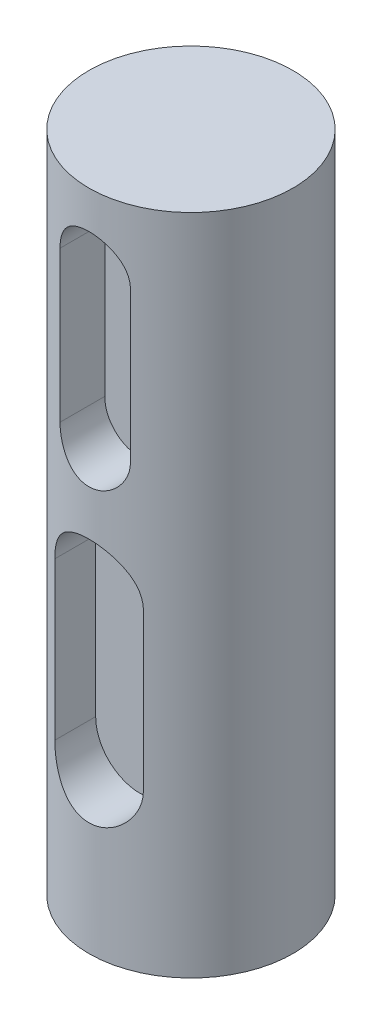
ISO-10303-21;
HEADER;
FILE_DESCRIPTION(('STEP AP214'),'2;1');
FILE_NAME('part.step','',(''),(''),'','','');
FILE_SCHEMA(('AUTOMOTIVE_DESIGN { 1 0 10303 214 1 1 1 1 }'));
ENDSEC;
DATA;
#1=APPLICATION_CONTEXT('core data for automotive mechanical design processes');
#2=APPLICATION_PROTOCOL_DEFINITION('international standard','automotive_design',2000,#1);
#3=PRODUCT_CONTEXT('',#1,'mechanical');
#4=PRODUCT('Part','Part','',(#3));
#5=PRODUCT_RELATED_PRODUCT_CATEGORY('part','',(#4));
#6=PRODUCT_DEFINITION_FORMATION('','',#4);
#7=PRODUCT_DEFINITION_CONTEXT('part definition',#1,'design');
#8=PRODUCT_DEFINITION('design','',#6,#7);
#9=PRODUCT_DEFINITION_SHAPE('','',#8);
#10=(LENGTH_UNIT() NAMED_UNIT(*) SI_UNIT(.MILLI.,.METRE.));
#11=(NAMED_UNIT(*) PLANE_ANGLE_UNIT() SI_UNIT($,.RADIAN.));
#12=(NAMED_UNIT(*) SI_UNIT($,.STERADIAN.) SOLID_ANGLE_UNIT());
#13=UNCERTAINTY_MEASURE_WITH_UNIT(LENGTH_MEASURE(1.E-05),#10,'distance_accuracy_value','');
#14=(GEOMETRIC_REPRESENTATION_CONTEXT(3) GLOBAL_UNCERTAINTY_ASSIGNED_CONTEXT((#13)) GLOBAL_UNIT_ASSIGNED_CONTEXT((#10,
#11,#12)) REPRESENTATION_CONTEXT('',''));
#15=CARTESIAN_POINT('',(0.,0.,0.));
#16=DIRECTION('',(0.,0.,1.));
#17=DIRECTION('',(1.,0.,0.));
#18=AXIS2_PLACEMENT_3D('',#15,#16,#17);
#19=CARTESIAN_POINT('',(0.,75.,0.));
#20=DIRECTION('',(0.,-1.,0.));
#21=DIRECTION('',(0.,0.,-1.));
#22=AXIS2_PLACEMENT_3D('',#19,#20,#21);
#23=CYLINDRICAL_SURFACE('',#22,10.);
#24=DIRECTION('',(0.,-1.,0.));
#25=VECTOR('',#24,1.);
#26=CARTESIAN_POINT('',(3.45139349236931,75.,9.3855145282947));
#27=LINE('',#26,#25);
#28=CARTESIAN_POINT('',(3.45139349236931,67.8686364286383,9.3855145282947));
#29=VERTEX_POINT('',#28);
#30=CARTESIAN_POINT('',(3.45139349236931,53.0923580394321,9.3855145282947));
#31=VERTEX_POINT('',#30);
#32=EDGE_CURVE('E11',#29,#31,#27,.T.);
#33=ORIENTED_EDGE('',*,*,#32,.T.);
#34=CARTESIAN_POINT('',(3.45139349236931,53.0923580394321,9.3855145282947));
#35=CARTESIAN_POINT('',(3.45140612786799,52.9984077749634,9.38549883426057));
#36=CARTESIAN_POINT('',(3.44755765372784,52.9044662244196,9.38692484077984));
#37=CARTESIAN_POINT('',(3.43223697145284,52.7173163896712,9.39254336080108));
#38=CARTESIAN_POINT('',(3.42076695496526,52.6241079024613,9.39673507899382));
#39=CARTESIAN_POINT('',(3.39034898753196,52.4393732130283,9.40775108013968));
#40=CARTESIAN_POINT('',(3.37142442601612,52.3478426771917,9.41456712748558));
#41=CARTESIAN_POINT('',(3.32629414472913,52.1668332510398,9.4306064178693));
#42=CARTESIAN_POINT('',(3.30008813337985,52.077354443039,9.43982975730374));
#43=CARTESIAN_POINT('',(3.21090649176565,51.8130286158874,9.47069594862097));
#44=CARTESIAN_POINT('',(3.1373191089705,51.6420034951577,9.49555353259536));
#45=CARTESIAN_POINT('',(2.96418519252545,51.3146925207388,9.55101164840874));
#46=CARTESIAN_POINT('',(2.86462126841096,51.1584166369981,9.5816160236792));
#47=CARTESIAN_POINT('',(2.63789489695557,50.8584665597019,9.64654907296298));
#48=CARTESIAN_POINT('',(2.50982932733845,50.7154946328364,9.68097494817365));
#49=CARTESIAN_POINT('',(2.23166211500476,50.4525764450172,9.74885415350118));
#50=CARTESIAN_POINT('',(2.081556471085,50.3326343740971,9.78230730570388));
#51=CARTESIAN_POINT('',(1.75834114453983,50.1159085420094,9.84561170816032));
#52=CARTESIAN_POINT('',(1.58470189941971,50.0198736779721,9.87533469893857));
#53=CARTESIAN_POINT('',(1.22253581781116,49.8586641148916,9.92667066553286));
#54=CARTESIAN_POINT('',(1.03401382331278,49.7934794268615,9.94828626597198));
#55=CARTESIAN_POINT('',(0.654847933975351,49.6982351784067,9.98028112073012));
#56=CARTESIAN_POINT('',(0.464542002482545,49.6669626530214,9.99104734640948));
#57=CARTESIAN_POINT('',(0.0810958477814093,49.6365654830078,10.0015082520218));
#58=CARTESIAN_POINT('',(-0.112043634345948,49.6374325773605,10.0012057770027));
#59=CARTESIAN_POINT('',(-0.487053320432518,49.6705390406981,9.98982080432155));
#60=CARTESIAN_POINT('',(-0.669056073105431,49.7014588454288,9.97919173834098));
#61=CARTESIAN_POINT('',(-1.02510762336699,49.7915999254573,9.94892431347629));
#62=CARTESIAN_POINT('',(-1.19915597425685,49.8508227880477,9.92928544930697));
#63=CARTESIAN_POINT('',(-1.53715411225807,49.996616137787,9.88264563239321));
#64=CARTESIAN_POINT('',(-1.70093420402338,50.0835478813725,9.85554811267488));
#65=CARTESIAN_POINT('',(-2.01195897166135,50.2819850557573,9.7967907887151));
#66=CARTESIAN_POINT('',(-2.15919886508254,50.3934975663999,9.76512967096045));
#67=CARTESIAN_POINT('',(-2.44078724674086,50.6445031038505,9.6986875209007));
#68=CARTESIAN_POINT('',(-2.57411858216121,50.7851191018012,9.66382965398807));
#69=CARTESIAN_POINT('',(-2.81566776490795,51.0869792896979,9.59623792656752));
#70=CARTESIAN_POINT('',(-2.92387709822334,51.248230444397,9.56350478884391));
#71=CARTESIAN_POINT('',(-3.11371606900094,51.5904515049359,9.50341614078055));
#72=CARTESIAN_POINT('',(-3.1948699301665,51.7717065568941,9.47615993374072));
#73=CARTESIAN_POINT('',(-3.29250655386418,52.05246754214,9.44248673399207));
#74=CARTESIAN_POINT('',(-3.32103338539075,52.1475160804337,9.43246535953065));
#75=CARTESIAN_POINT('',(-3.36983865345072,52.3399376342832,9.41514009469484));
#76=CARTESIAN_POINT('',(-3.3901208435351,52.4373095706369,9.40783496781959));
#77=CARTESIAN_POINT('',(-3.42120257768973,52.6274150854512,9.39657602397849));
#78=CARTESIAN_POINT('',(-3.43251943260663,52.720053965635,9.39243992670911));
#79=CARTESIAN_POINT('',(-3.44761614848623,52.9059112687874,9.3869033662072));
#80=CARTESIAN_POINT('',(-3.45140509563415,52.9991288566965,9.38549960508638));
#81=CARTESIAN_POINT('',(-3.45139349236931,53.0923580394321,9.3855145282947));
#82=B_SPLINE_CURVE_WITH_KNOTS('',3,(#34,#35,#36,#37,#38,#39,#40,#41,#42,#43,#44,#45,#46,#47,#48,
#49,#50,#51,#52,#53,#54,#55,#56,#57,#58,#59,#60,#61,#62,#63,#64,#65,#66,#67,#68,#69,#70,#71,#72,
#73,#74,#75,#76,#77,#78,#79,#80,#81),.UNSPECIFIED.,.F.,.F.,(4,2,2,2,2,2,2,2,2,2,2,2,2,2,2,2,2,2,
2,2,2,2,2,4),(0.,0.281746497599051,0.563412011344665,0.844200720246425,1.12500067466245,
1.68573182049851,2.24683932548783,2.82921708265258,3.41170069696743,4.01061910962744,
4.60934346543511,5.18586416954318,5.76223668846593,6.31439424510656,6.86658277149219,
7.42628712530874,7.98615289837194,8.57410276491918,9.16225160159162,9.76025596015036,
10.0591488506682,10.3579055109281,10.6378230676927,10.9174025581944),.UNSPECIFIED.);
#83=CARTESIAN_POINT('',(-3.45139349236931,53.0923580394321,9.3855145282947));
#84=VERTEX_POINT('',#83);
#85=EDGE_CURVE('E214',#31,#84,#82,.T.);
#86=ORIENTED_EDGE('',*,*,#85,.T.);
#87=DIRECTION('',(0.,-1.,0.));
#88=VECTOR('',#87,1.);
#89=CARTESIAN_POINT('',(-3.45139349236931,75.,9.3855145282947));
#90=LINE('',#89,#88);
#91=CARTESIAN_POINT('',(-3.45139349236931,67.8686364286383,9.3855145282947));
#92=VERTEX_POINT('',#91);
#93=EDGE_CURVE('E45',#84,#92,#90,.F.);
#94=ORIENTED_EDGE('',*,*,#93,.T.);
#95=CARTESIAN_POINT('',(-3.45139349236931,67.8686364286383,9.3855145282947));
#96=CARTESIAN_POINT('',(-3.45140612786799,67.9625866931071,9.38549883426057));
#97=CARTESIAN_POINT('',(-3.44755765372784,68.0565282436508,9.38692484077984));
#98=CARTESIAN_POINT('',(-3.43223697145284,68.2436780783992,9.39254336080108));
#99=CARTESIAN_POINT('',(-3.42076695496525,68.3368865656091,9.39673507899382));
#100=CARTESIAN_POINT('',(-3.39034898753196,68.5216212550421,9.40775108013968));
#101=CARTESIAN_POINT('',(-3.37142442601612,68.6131517908787,9.41456712748558));
#102=CARTESIAN_POINT('',(-3.32629414472913,68.7941612170306,9.4306064178693));
#103=CARTESIAN_POINT('',(-3.30008813337986,68.8836400250314,9.43982975730374));
#104=CARTESIAN_POINT('',(-3.21090649176565,69.147965852183,9.47069594862097));
#105=CARTESIAN_POINT('',(-3.1373191089705,69.3189909729127,9.49555353259535));
#106=CARTESIAN_POINT('',(-2.96418519252545,69.6463019473317,9.55101164840874));
#107=CARTESIAN_POINT('',(-2.86462126841097,69.8025778310724,9.5816160236792));
#108=CARTESIAN_POINT('',(-2.63789489695558,70.1025279083685,9.64654907296298));
#109=CARTESIAN_POINT('',(-2.50982932733845,70.2454998352341,9.68097494817365));
#110=CARTESIAN_POINT('',(-2.23166211500476,70.5084180230533,9.74885415350118));
#111=CARTESIAN_POINT('',(-2.081556471085,70.6283600939733,9.78230730570388));
#112=CARTESIAN_POINT('',(-1.75834114453983,70.845085926061,9.84561170816032));
#113=CARTESIAN_POINT('',(-1.58470189941971,70.9411207900983,9.87533469893857));
#114=CARTESIAN_POINT('',(-1.22253581781116,71.1023303531788,9.92667066553286));
#115=CARTESIAN_POINT('',(-1.03401382331278,71.1675150412089,9.94828626597198));
#116=CARTESIAN_POINT('',(-0.654847933975361,71.2627592896637,9.98028112073012));
#117=CARTESIAN_POINT('',(-0.464542002482553,71.2940318150491,9.99104734640947));
#118=CARTESIAN_POINT('',(-0.0810958477814162,71.3244289850626,10.0015082520218));
#119=CARTESIAN_POINT('',(0.112043634345941,71.3235618907099,10.0012057770027));
#120=CARTESIAN_POINT('',(0.48705332043251,71.2904554273724,9.98982080432155));
#121=CARTESIAN_POINT('',(0.669056073105424,71.2595356226416,9.97919173834098));
#122=CARTESIAN_POINT('',(1.02510762336698,71.1693945426131,9.94892431347629));
#123=CARTESIAN_POINT('',(1.19915597425684,71.1101716800228,9.92928544930698));
#124=CARTESIAN_POINT('',(1.53715411225806,70.9643783302834,9.88264563239321));
#125=CARTESIAN_POINT('',(1.70093420402338,70.8774465866979,9.85554811267489));
#126=CARTESIAN_POINT('',(2.01195897166135,70.6790094123131,9.7967907887151));
#127=CARTESIAN_POINT('',(2.15919886508254,70.5674969016705,9.76512967096045));
#128=CARTESIAN_POINT('',(2.44078724674086,70.31649136422,9.6986875209007));
#129=CARTESIAN_POINT('',(2.57411858216121,70.1758753662692,9.66382965398807));
#130=CARTESIAN_POINT('',(2.81566776490795,69.8740151783725,9.59623792656752));
#131=CARTESIAN_POINT('',(2.92387709822334,69.7127640236734,9.56350478884391));
#132=CARTESIAN_POINT('',(3.11371606900094,69.3705429631346,9.50341614078055));
#133=CARTESIAN_POINT('',(3.1948699301665,69.1892879111763,9.47615993374072));
#134=CARTESIAN_POINT('',(3.29250655386418,68.9085269259304,9.44248673399207));
#135=CARTESIAN_POINT('',(3.32103338539076,68.8134783876367,9.43246535953065));
#136=CARTESIAN_POINT('',(3.36983865345072,68.6210568337873,9.41514009469484));
#137=CARTESIAN_POINT('',(3.3901208435351,68.5236848974335,9.40783496781959));
#138=CARTESIAN_POINT('',(3.42120257768973,68.3335793826193,9.39657602397849));
#139=CARTESIAN_POINT('',(3.43251943260663,68.2409405024354,9.39243992670911));
#140=CARTESIAN_POINT('',(3.44761614848623,68.055083199283,9.3869033662072));
#141=CARTESIAN_POINT('',(3.45140509563415,67.961865611374,9.38549960508638));
#142=CARTESIAN_POINT('',(3.45139349236931,67.8686364286383,9.3855145282947));
#143=B_SPLINE_CURVE_WITH_KNOTS('',3,(#95,#96,#97,#98,#99,#100,#101,#102,#103,#104,#105,#106,
#107,#108,#109,#110,#111,#112,#113,#114,#115,#116,#117,#118,#119,#120,#121,#122,#123,#124,#125,
#126,#127,#128,#129,#130,#131,#132,#133,#134,#135,#136,#137,#138,#139,#140,#141,#142),
.UNSPECIFIED.,.F.,.F.,(4,2,2,2,2,2,2,2,2,2,2,2,2,2,2,2,2,2,2,2,2,2,2,4),(0.,0.281746497599072,
0.563412011344679,0.844200720246432,1.12500067466244,1.68573182049851,2.24683932548783,
2.82921708265257,3.41170069696744,4.01061910962744,4.6093434654351,5.18586416954318,
5.76223668846592,6.31439424510655,6.86658277149218,7.42628712530875,7.98615289837194,
8.57410276491918,9.16225160159161,9.76025596015036,10.0591488506682,10.3579055109281,
10.6378230676926,10.9174025581944),.UNSPECIFIED.);
#144=EDGE_CURVE('E52',#92,#29,#143,.T.);
#145=ORIENTED_EDGE('',*,*,#144,.T.);
#146=EDGE_LOOP('',(#33,#86,#94,#145));
#147=FACE_BOUND('',#146,.T.);
#148=DIRECTION('',(0.,-1.,0.));
#149=VECTOR('',#148,1.);
#150=CARTESIAN_POINT('',(4.34180890613552,75.,9.00825706907848));
#151=LINE('',#150,#149);
#152=CARTESIAN_POINT('',(4.34180890613552,40.8597330821287,9.00825706907848));
#153=VERTEX_POINT('',#152);
#154=CARTESIAN_POINT('',(4.34180890613552,25.4566491056003,9.00825706907848));
#155=VERTEX_POINT('',#154);
#156=EDGE_CURVE('E209',#153,#155,#151,.T.);
#157=ORIENTED_EDGE('',*,*,#156,.T.);
#158=CARTESIAN_POINT('',(4.34180890613552,25.4566491056003,9.00825706907848));
#159=CARTESIAN_POINT('',(4.34182724461981,25.3408149052285,9.00823013246618));
#160=CARTESIAN_POINT('',(4.33717398328722,25.2249954143458,9.01049061113648));
#161=CARTESIAN_POINT('',(4.31866781163577,24.9943134804879,9.01938467250451));
#162=CARTESIAN_POINT('',(4.3048190438105,24.8794506301362,9.02601628603518));
#163=CARTESIAN_POINT('',(4.26814783871389,24.6520164242164,9.04341201286348));
#164=CARTESIAN_POINT('',(4.24536604801934,24.5394370850199,9.05415740270546));
#165=CARTESIAN_POINT('',(4.19109816671214,24.3168511928679,9.07940461833777));
#166=CARTESIAN_POINT('',(4.15961140712572,24.2068448383503,9.09390673282565));
#167=CARTESIAN_POINT('',(4.0526365797753,23.8820905840803,9.14233645627512));
#168=CARTESIAN_POINT('',(3.9645480693557,23.6720839273993,9.18123084065091));
#169=CARTESIAN_POINT('',(3.7576525033788,23.2697111752316,9.26782382750569));
#170=CARTESIAN_POINT('',(3.63881034442327,23.077365580917,9.3155324730027));
#171=CARTESIAN_POINT('',(3.36532499805745,22.7029517380872,9.41791786550619));
#172=CARTESIAN_POINT('',(3.20894390473299,22.5222202049274,9.4728419397932));
#173=CARTESIAN_POINT('',(2.86834605023921,22.1885168346007,9.58146326283648));
#174=CARTESIAN_POINT('',(2.68412305839682,22.0355512280132,9.63516023387788));
#175=CARTESIAN_POINT('',(2.38535453695503,21.8266136556791,9.71192084563093));
#176=CARTESIAN_POINT('',(2.27932326631197,21.7591035727536,9.73741108635828));
#177=CARTESIAN_POINT('',(2.06138362056905,21.633324871692,9.78586383727007));
#178=CARTESIAN_POINT('',(1.94947769204923,21.5750524464206,9.80882738758479));
#179=CARTESIAN_POINT('',(1.7205069692343,21.4682755679793,9.85156967389897));
#180=CARTESIAN_POINT('',(1.60344182287131,21.4197717826887,9.87134819212011));
#181=CARTESIAN_POINT('',(1.36505673048719,21.3330586320306,9.90712536752574));
#182=CARTESIAN_POINT('',(1.24373899434144,21.2948440069256,9.92312595544164));
#183=CARTESIAN_POINT('',(1.0045937310524,21.2309475411932,9.9500984147903));
#184=CARTESIAN_POINT('',(0.886946425895842,21.2046876425537,9.96130017227512));
#185=CARTESIAN_POINT('',(0.649612634023115,21.1620203380404,9.97958712647161));
#186=CARTESIAN_POINT('',(0.529927097646373,21.1456084631644,9.98667419037091));
#187=CARTESIAN_POINT('',(0.289445108804953,21.1228156889271,9.99653449072091));
#188=CARTESIAN_POINT('',(0.168648823397807,21.116433305163,9.9993083655394));
#189=CARTESIAN_POINT('',(-0.0730735569470918,21.1137730789195,10.0004632673725));
#190=CARTESIAN_POINT('',(-0.193999646108182,21.1174948040111,9.99884448238126));
#191=CARTESIAN_POINT('',(-0.426991293194709,21.1344148171891,9.99151402914292));
#192=CARTESIAN_POINT('',(-0.539113084905736,21.1469689143453,9.9860806339406));
#193=CARTESIAN_POINT('',(-0.761844711513141,21.1807176632143,9.97156223325143));
#194=CARTESIAN_POINT('',(-0.872454036546055,21.2019151579084,9.96247602629773));
#195=CARTESIAN_POINT('',(-1.09134015588389,21.2527347756337,9.94087827340608));
#196=CARTESIAN_POINT('',(-1.19961775336942,21.2823539461591,9.92836792797407));
#197=CARTESIAN_POINT('',(-1.41320543048611,21.3497382336508,9.90022645063931));
#198=CARTESIAN_POINT('',(-1.51851436240624,21.3875064535693,9.88459413013643));
#199=CARTESIAN_POINT('',(-1.83209911493526,21.5138193208238,9.8330345709591));
#200=CARTESIAN_POINT('',(-2.03487680449865,21.6146352465805,9.79277032974341));
#201=CARTESIAN_POINT('',(-2.42106545407472,21.8454893465985,9.70452637292781));
#202=CARTESIAN_POINT('',(-2.60446911852526,21.9755384717797,9.65654376790631));
#203=CARTESIAN_POINT('',(-2.96156167391685,22.2725662328974,9.553335998702));
#204=CARTESIAN_POINT('',(-3.133470606129,22.4415922179859,9.49783753426305));
#205=CARTESIAN_POINT('',(-3.4473851052788,22.8062354595031,9.38846274336694));
#206=CARTESIAN_POINT('',(-3.58937360824201,23.0018677857665,9.33458735749951));
#207=CARTESIAN_POINT('',(-3.77944308926819,23.3158746177386,9.25854861663665));
#208=CARTESIAN_POINT('',(-3.83988631093549,23.4262612301518,9.23357600636603));
#209=CARTESIAN_POINT('',(-3.95115794505922,23.6523469377645,9.18651165374144));
#210=CARTESIAN_POINT('',(-4.0019905667425,23.7680436795249,9.16441865150689));
#211=CARTESIAN_POINT('',(-4.09348099180326,24.0038283298098,9.12392026229833));
#212=CARTESIAN_POINT('',(-4.13415284488484,24.1239099087637,9.10550979044674));
#213=CARTESIAN_POINT('',(-4.2049405554747,24.3676658641119,9.07303584104469));
#214=CARTESIAN_POINT('',(-4.23506110349421,24.4913386175286,9.05897043225523));
#215=CARTESIAN_POINT('',(-4.28691399236448,24.7542290027271,9.03456320991037));
#216=CARTESIAN_POINT('',(-4.3074592848022,24.8937333150865,9.02475574104275));
#217=CARTESIAN_POINT('',(-4.33492806039336,25.1743671215596,9.0115726266899));
#218=CARTESIAN_POINT('',(-4.34185201318628,25.3154965594731,9.00819675945465));
#219=CARTESIAN_POINT('',(-4.34180890613552,25.4566491056003,9.00825706907848));
#220=B_SPLINE_CURVE_WITH_KNOTS('',3,(#158,#159,#160,#161,#162,#163,#164,#165,#166,#167,#168,
#169,#170,#171,#172,#173,#174,#175,#176,#177,#178,#179,#180,#181,#182,#183,#184,#185,#186,#187,
#188,#189,#190,#191,#192,#193,#194,#195,#196,#197,#198,#199,#200,#201,#202,#203,#204,#205,#206,
#207,#208,#209,#210,#211,#212,#213,#214,#215,#216,#217,#218,#219),.UNSPECIFIED.,.F.,.F.,(4,2,2,
2,2,2,2,2,2,2,2,2,2,2,2,2,2,2,2,2,2,2,2,2,2,2,2,2,2,2,4),(0.,0.347362768976528,
0.694569160197706,1.04021370932925,1.38588482850933,2.07565014971817,2.76620629534976,
3.49876507824865,4.23148804217366,4.6158496578193,5.00005245155264,5.3842815042186,
5.76831376749165,6.13102301821189,6.49356754788822,6.85605841453544,7.21853376777757,
7.55699390187755,7.89556545200513,8.23401845036879,8.57260055124069,9.2594217839576,
9.94650073378856,10.6854733642269,11.4248663056511,11.8093642853058,12.1936934713817,
12.577488251416,12.9611122009178,13.3843417526375,13.8075567119014),.UNSPECIFIED.);
#221=CARTESIAN_POINT('',(-4.34180890613552,25.4566491056003,9.00825706907848));
#222=VERTEX_POINT('',#221);
#223=EDGE_CURVE('E160',#155,#222,#220,.T.);
#224=ORIENTED_EDGE('',*,*,#223,.T.);
#225=DIRECTION('',(0.,-1.,0.));
#226=VECTOR('',#225,1.);
#227=CARTESIAN_POINT('',(-4.34180890613552,75.,9.00825706907848));
#228=LINE('',#227,#226);
#229=CARTESIAN_POINT('',(-4.34180890613552,40.8597330821287,9.00825706907848));
#230=VERTEX_POINT('',#229);
#231=EDGE_CURVE('E215',#222,#230,#228,.F.);
#232=ORIENTED_EDGE('',*,*,#231,.T.);
#233=CARTESIAN_POINT('',(-4.34180890613552,40.8597330821287,9.00825706907848));
#234=CARTESIAN_POINT('',(-4.34182724461981,40.9755672825004,9.00823013246618));
#235=CARTESIAN_POINT('',(-4.33717398328722,41.0913867733831,9.01049061113648));
#236=CARTESIAN_POINT('',(-4.31866781163577,41.3220687072411,9.01938467250451));
#237=CARTESIAN_POINT('',(-4.3048190438105,41.4369315575928,9.02601628603518));
#238=CARTESIAN_POINT('',(-4.26814783871389,41.6643657635126,9.04341201286348));
#239=CARTESIAN_POINT('',(-4.24536604801934,41.776945102709,9.05415740270546));
#240=CARTESIAN_POINT('',(-4.19109816671214,41.999530994861,9.07940461833777));
#241=CARTESIAN_POINT('',(-4.15961140712572,42.1095373493786,9.09390673282565));
#242=CARTESIAN_POINT('',(-4.0526365797753,42.4342916036486,9.14233645627512));
#243=CARTESIAN_POINT('',(-3.9645480693557,42.6442982603296,9.18123084065091));
#244=CARTESIAN_POINT('',(-3.7576525033788,43.0466710124973,9.26782382750569));
#245=CARTESIAN_POINT('',(-3.63881034442327,43.239016606812,9.3155324730027));
#246=CARTESIAN_POINT('',(-3.36532499805745,43.6134304496418,9.41791786550619));
#247=CARTESIAN_POINT('',(-3.20894390473299,43.7941619828016,9.4728419397932));
#248=CARTESIAN_POINT('',(-2.8683460502392,44.1278653531282,9.58146326283648));
#249=CARTESIAN_POINT('',(-2.68412305839682,44.2808309597157,9.63516023387788));
#250=CARTESIAN_POINT('',(-2.38535453695502,44.4897685320498,9.71192084563093));
#251=CARTESIAN_POINT('',(-2.27932326631196,44.5572786149753,9.73741108635828));
#252=CARTESIAN_POINT('',(-2.06138362056904,44.683057316037,9.78586383727007));
#253=CARTESIAN_POINT('',(-1.94947769204922,44.7413297413083,9.80882738758479));
#254=CARTESIAN_POINT('',(-1.7205069692343,44.8481066197496,9.85156967389897));
#255=CARTESIAN_POINT('',(-1.6034418228713,44.8966104050403,9.87134819212011));
#256=CARTESIAN_POINT('',(-1.36505673048718,44.9833235556983,9.90712536752574));
#257=CARTESIAN_POINT('',(-1.24373899434144,45.0215381808033,9.92312595544164));
#258=CARTESIAN_POINT('',(-1.0045937310524,45.0854346465358,9.9500984147903));
#259=CARTESIAN_POINT('',(-0.88694642589584,45.1116945451753,9.96130017227512));
#260=CARTESIAN_POINT('',(-0.649612634023113,45.1543618496885,9.97958712647161));
#261=CARTESIAN_POINT('',(-0.529927097646372,45.1707737245646,9.98667419037091));
#262=CARTESIAN_POINT('',(-0.289445108804953,45.1935664988018,9.99653449072091));
#263=CARTESIAN_POINT('',(-0.168648823397807,45.199948882566,9.9993083655394));
#264=CARTESIAN_POINT('',(0.0730735569470916,45.2026091088094,10.0004632673725));
#265=CARTESIAN_POINT('',(0.193999646108182,45.1988873837178,9.99884448238126));
#266=CARTESIAN_POINT('',(0.426991293194709,45.1819673705399,9.99151402914292));
#267=CARTESIAN_POINT('',(0.539113084905737,45.1694132733837,9.9860806339406));
#268=CARTESIAN_POINT('',(0.761844711513143,45.1356645245147,9.97156223325143));
#269=CARTESIAN_POINT('',(0.872454036546058,45.1144670298206,9.96247602629773));
#270=CARTESIAN_POINT('',(1.09134015588389,45.0636474120952,9.94087827340607));
#271=CARTESIAN_POINT('',(1.19961775336942,45.0340282415699,9.92836792797407));
#272=CARTESIAN_POINT('',(1.41320543048611,44.9666439540782,9.90022645063931));
#273=CARTESIAN_POINT('',(1.51851436240624,44.9288757341596,9.88459413013643));
#274=CARTESIAN_POINT('',(1.83209911493526,44.8025628669052,9.8330345709591));
#275=CARTESIAN_POINT('',(2.03487680449865,44.7017469411484,9.79277032974342));
#276=CARTESIAN_POINT('',(2.42106545407472,44.4708928411304,9.70452637292781));
#277=CARTESIAN_POINT('',(2.60446911852526,44.3408437159492,9.65654376790631));
#278=CARTESIAN_POINT('',(2.96156167391686,44.0438159548316,9.553335998702));
#279=CARTESIAN_POINT('',(3.13347060612901,43.874789969743,9.49783753426305));
#280=CARTESIAN_POINT('',(3.4473851052788,43.5101467282259,9.38846274336693));
#281=CARTESIAN_POINT('',(3.58937360824201,43.3145144019624,9.33458735749951));
#282=CARTESIAN_POINT('',(3.77944308926819,43.0005075699904,9.25854861663665));
#283=CARTESIAN_POINT('',(3.83988631093549,42.8901209575772,9.23357600636603));
#284=CARTESIAN_POINT('',(3.95115794505922,42.6640352499644,9.18651165374143));
#285=CARTESIAN_POINT('',(4.0019905667425,42.5483385082041,9.16441865150689));
#286=CARTESIAN_POINT('',(4.09348099180326,42.3125538579192,9.12392026229833));
#287=CARTESIAN_POINT('',(4.13415284488484,42.1924722789652,9.10550979044674));
#288=CARTESIAN_POINT('',(4.2049405554747,41.9487163236171,9.07303584104469));
#289=CARTESIAN_POINT('',(4.23506110349421,41.8250435702003,9.05897043225523));
#290=CARTESIAN_POINT('',(4.28691399236448,41.5621531850019,9.03456320991037));
#291=CARTESIAN_POINT('',(4.3074592848022,41.4226488726424,9.02475574104275));
#292=CARTESIAN_POINT('',(4.33492806039336,41.1420150661693,9.0115726266899));
#293=CARTESIAN_POINT('',(4.34185201318628,41.0008856282559,9.00819675945465));
#294=CARTESIAN_POINT('',(4.34180890613552,40.8597330821287,9.00825706907848));
#295=B_SPLINE_CURVE_WITH_KNOTS('',3,(#233,#234,#235,#236,#237,#238,#239,#240,#241,#242,#243,
#244,#245,#246,#247,#248,#249,#250,#251,#252,#253,#254,#255,#256,#257,#258,#259,#260,#261,#262,
#263,#264,#265,#266,#267,#268,#269,#270,#271,#272,#273,#274,#275,#276,#277,#278,#279,#280,#281,
#282,#283,#284,#285,#286,#287,#288,#289,#290,#291,#292,#293,#294),.UNSPECIFIED.,.F.,.F.,(4,2,2,
2,2,2,2,2,2,2,2,2,2,2,2,2,2,2,2,2,2,2,2,2,2,2,2,2,2,2,4),(0.,0.347362768976542,
0.694569160197713,1.04021370932923,1.38588482850933,2.07565014971817,2.76620629534976,
3.49876507824865,4.23148804217366,4.61584965781931,5.00005245155264,5.3842815042186,
5.76831376749165,6.13102301821189,6.49356754788822,6.85605841453544,7.21853376777757,
7.55699390187755,7.89556545200513,8.23401845036879,8.57260055124069,9.25942178395759,
9.94650073378856,10.6854733642269,11.4248663056511,11.8093642853058,12.1936934713817,
12.577488251416,12.9611122009178,13.3843417526375,13.8075567119014),.UNSPECIFIED.);
#296=EDGE_CURVE('E60',#230,#153,#295,.T.);
#297=ORIENTED_EDGE('',*,*,#296,.T.);
#298=EDGE_LOOP('',(#157,#224,#232,#297));
#299=FACE_BOUND('',#298,.T.);
#300=CARTESIAN_POINT('',(0.,75.,0.));
#301=DIRECTION('',(0.,1.,0.));
#302=DIRECTION('',(0.,0.,1.));
#303=AXIS2_PLACEMENT_3D('',#300,#301,#302);
#304=CIRCLE('',#303,10.);
#305=CARTESIAN_POINT('',(0.,75.,10.));
#306=VERTEX_POINT('',#305);
#307=EDGE_CURVE('E157',#306,#306,#304,.T.);
#308=ORIENTED_EDGE('',*,*,#307,.F.);
#309=EDGE_LOOP('',(#308));
#310=FACE_BOUND('',#309,.T.);
#311=CARTESIAN_POINT('',(0.,10.,0.));
#312=DIRECTION('',(0.,1.,0.));
#313=DIRECTION('',(0.,0.,1.));
#314=AXIS2_PLACEMENT_3D('',#311,#312,#313);
#315=CIRCLE('',#314,10.);
#316=CARTESIAN_POINT('',(0.,10.,10.));
#317=VERTEX_POINT('',#316);
#318=EDGE_CURVE('E149',#317,#317,#315,.T.);
#319=ORIENTED_EDGE('',*,*,#318,.T.);
#320=EDGE_LOOP('',(#319));
#321=FACE_BOUND('',#320,.T.);
#322=ADVANCED_FACE('F37',(#147,#299,#310,#321),#23,.T.);
#323=CARTESIAN_POINT('',(0.,75.,0.));
#324=DIRECTION('',(0.,1.,0.));
#325=DIRECTION('',(0.,0.,1.));
#326=AXIS2_PLACEMENT_3D('',#323,#324,#325);
#327=PLANE('',#326);
#328=ORIENTED_EDGE('',*,*,#307,.T.);
#329=EDGE_LOOP('',(#328));
#330=FACE_BOUND('',#329,.T.);
#331=ADVANCED_FACE('F193',(#330),#327,.T.);
#332=CARTESIAN_POINT('',(0.,10.,0.));
#333=DIRECTION('',(0.,1.,0.));
#334=DIRECTION('',(0.,0.,1.));
#335=AXIS2_PLACEMENT_3D('',#332,#333,#334);
#336=PLANE('',#335);
#337=ORIENTED_EDGE('',*,*,#318,.F.);
#338=EDGE_LOOP('',(#337));
#339=FACE_BOUND('',#338,.T.);
#340=ADVANCED_FACE('F192',(#339),#336,.F.);
#341=CARTESIAN_POINT('',(0.,40.8597330821287,5.));
#342=DIRECTION('',(0.,0.,1.));
#343=DIRECTION('',(1.,0.,0.));
#344=AXIS2_PLACEMENT_3D('',#341,#342,#343);
#345=CYLINDRICAL_SURFACE('',#344,4.34180890613552);
#346=DIRECTION('',(0.,0.,1.));
#347=VECTOR('',#346,1.);
#348=CARTESIAN_POINT('',(-4.34180890613552,40.8597330821287,5.));
#349=LINE('',#348,#347);
#350=CARTESIAN_POINT('',(-4.34180890613552,40.8597330821287,5.));
#351=VERTEX_POINT('',#350);
#352=EDGE_CURVE('E146',#351,#230,#349,.T.);
#353=ORIENTED_EDGE('',*,*,#352,.F.);
#354=CARTESIAN_POINT('',(0.,40.8597330821287,5.));
#355=DIRECTION('',(0.,0.,1.));
#356=DIRECTION('',(1.,0.,0.));
#357=AXIS2_PLACEMENT_3D('',#354,#355,#356);
#358=CIRCLE('',#357,4.34180890613552);
#359=CARTESIAN_POINT('',(4.34180890613552,40.8597330821287,5.));
#360=VERTEX_POINT('',#359);
#361=EDGE_CURVE('E130',#360,#351,#358,.T.);
#362=ORIENTED_EDGE('',*,*,#361,.F.);
#363=DIRECTION('',(0.,0.,1.));
#364=VECTOR('',#363,1.);
#365=CARTESIAN_POINT('',(4.34180890613552,40.8597330821287,5.));
#366=LINE('',#365,#364);
#367=EDGE_CURVE('E147',#360,#153,#366,.T.);
#368=ORIENTED_EDGE('',*,*,#367,.T.);
#369=ORIENTED_EDGE('',*,*,#296,.F.);
#370=EDGE_LOOP('',(#353,#362,#368,#369));
#371=FACE_BOUND('',#370,.T.);
#372=ADVANCED_FACE('F188',(#371),#345,.F.);
#373=CARTESIAN_POINT('',(4.34180890613552,40.8597330821287,5.));
#374=DIRECTION('',(1.,0.,0.));
#375=DIRECTION('',(0.,0.,-1.));
#376=AXIS2_PLACEMENT_3D('',#373,#374,#375);
#377=PLANE('',#376);
#378=ORIENTED_EDGE('',*,*,#367,.F.);
#379=DIRECTION('',(0.,1.,0.));
#380=VECTOR('',#379,1.);
#381=CARTESIAN_POINT('',(4.34180890613552,40.8597330821287,5.));
#382=LINE('',#381,#380);
#383=CARTESIAN_POINT('',(4.34180890613552,25.4566491056003,5.));
#384=VERTEX_POINT('',#383);
#385=EDGE_CURVE('E143',#384,#360,#382,.T.);
#386=ORIENTED_EDGE('',*,*,#385,.F.);
#387=DIRECTION('',(0.,0.,1.));
#388=VECTOR('',#387,1.);
#389=CARTESIAN_POINT('',(4.34180890613552,25.4566491056003,5.));
#390=LINE('',#389,#388);
#391=EDGE_CURVE('E150',#384,#155,#390,.T.);
#392=ORIENTED_EDGE('',*,*,#391,.T.);
#393=ORIENTED_EDGE('',*,*,#156,.F.);
#394=EDGE_LOOP('',(#378,#386,#392,#393));
#395=FACE_BOUND('',#394,.T.);
#396=ADVANCED_FACE('F182',(#395),#377,.F.);
#397=CARTESIAN_POINT('',(0.,25.4566491056003,5.));
#398=DIRECTION('',(0.,0.,1.));
#399=DIRECTION('',(1.,0.,0.));
#400=AXIS2_PLACEMENT_3D('',#397,#398,#399);
#401=CYLINDRICAL_SURFACE('',#400,4.34180890613552);
#402=ORIENTED_EDGE('',*,*,#391,.F.);
#403=CARTESIAN_POINT('',(0.,25.4566491056003,5.));
#404=DIRECTION('',(0.,0.,1.));
#405=DIRECTION('',(1.,0.,0.));
#406=AXIS2_PLACEMENT_3D('',#403,#404,#405);
#407=CIRCLE('',#406,4.34180890613552);
#408=CARTESIAN_POINT('',(-4.34180890613552,25.4566491056003,5.));
#409=VERTEX_POINT('',#408);
#410=EDGE_CURVE('E140',#409,#384,#407,.T.);
#411=ORIENTED_EDGE('',*,*,#410,.F.);
#412=DIRECTION('',(0.,0.,1.));
#413=VECTOR('',#412,1.);
#414=CARTESIAN_POINT('',(-4.34180890613552,25.4566491056003,5.));
#415=LINE('',#414,#413);
#416=EDGE_CURVE('E153',#409,#222,#415,.T.);
#417=ORIENTED_EDGE('',*,*,#416,.T.);
#418=ORIENTED_EDGE('',*,*,#223,.F.);
#419=EDGE_LOOP('',(#402,#411,#417,#418));
#420=FACE_BOUND('',#419,.T.);
#421=ADVANCED_FACE('F176',(#420),#401,.F.);
#422=CARTESIAN_POINT('',(-4.34180890613552,40.8597330821287,5.));
#423=DIRECTION('',(-1.,0.,0.));
#424=DIRECTION('',(0.,0.,1.));
#425=AXIS2_PLACEMENT_3D('',#422,#423,#424);
#426=PLANE('',#425);
#427=ORIENTED_EDGE('',*,*,#416,.F.);
#428=DIRECTION('',(0.,-1.,0.));
#429=VECTOR('',#428,1.);
#430=CARTESIAN_POINT('',(-4.34180890613552,40.8597330821287,5.));
#431=LINE('',#430,#429);
#432=EDGE_CURVE('E137',#351,#409,#431,.T.);
#433=ORIENTED_EDGE('',*,*,#432,.F.);
#434=ORIENTED_EDGE('',*,*,#352,.T.);
#435=ORIENTED_EDGE('',*,*,#231,.F.);
#436=EDGE_LOOP('',(#427,#433,#434,#435));
#437=FACE_BOUND('',#436,.T.);
#438=ADVANCED_FACE('F181',(#437),#426,.F.);
#439=CARTESIAN_POINT('',(0.,40.8597330821287,5.));
#440=DIRECTION('',(0.,0.,1.));
#441=DIRECTION('',(1.,0.,0.));
#442=AXIS2_PLACEMENT_3D('',#439,#440,#441);
#443=PLANE('',#442);
#444=ORIENTED_EDGE('',*,*,#361,.T.);
#445=ORIENTED_EDGE('',*,*,#432,.T.);
#446=ORIENTED_EDGE('',*,*,#410,.T.);
#447=ORIENTED_EDGE('',*,*,#385,.T.);
#448=EDGE_LOOP('',(#444,#445,#446,#447));
#449=FACE_BOUND('',#448,.T.);
#450=ADVANCED_FACE('F186',(#449),#443,.T.);
#451=CARTESIAN_POINT('',(0.,67.8686364286383,5.));
#452=DIRECTION('',(0.,0.,1.));
#453=DIRECTION('',(1.,0.,0.));
#454=AXIS2_PLACEMENT_3D('',#451,#452,#453);
#455=CYLINDRICAL_SURFACE('',#454,3.45139349236931);
#456=DIRECTION('',(0.,0.,1.));
#457=VECTOR('',#456,1.);
#458=CARTESIAN_POINT('',(-3.45139349236931,67.8686364286383,5.));
#459=LINE('',#458,#457);
#460=CARTESIAN_POINT('',(-3.45139349236931,67.8686364286383,5.));
#461=VERTEX_POINT('',#460);
#462=EDGE_CURVE('E102',#461,#92,#459,.T.);
#463=ORIENTED_EDGE('',*,*,#462,.F.);
#464=CARTESIAN_POINT('',(0.,67.8686364286383,5.));
#465=DIRECTION('',(0.,0.,1.));
#466=DIRECTION('',(1.,0.,0.));
#467=AXIS2_PLACEMENT_3D('',#464,#465,#466);
#468=CIRCLE('',#467,3.45139349236931);
#469=CARTESIAN_POINT('',(3.45139349236931,67.8686364286383,5.));
#470=VERTEX_POINT('',#469);
#471=EDGE_CURVE('E106',#470,#461,#468,.T.);
#472=ORIENTED_EDGE('',*,*,#471,.F.);
#473=DIRECTION('',(0.,0.,1.));
#474=VECTOR('',#473,1.);
#475=CARTESIAN_POINT('',(3.45139349236931,67.8686364286383,5.));
#476=LINE('',#475,#474);
#477=EDGE_CURVE('E128',#470,#29,#476,.T.);
#478=ORIENTED_EDGE('',*,*,#477,.T.);
#479=ORIENTED_EDGE('',*,*,#144,.F.);
#480=EDGE_LOOP('',(#463,#472,#478,#479));
#481=FACE_BOUND('',#480,.T.);
#482=ADVANCED_FACE('F104',(#481),#455,.F.);
#483=CARTESIAN_POINT('',(3.45139349236931,67.8686364286383,5.));
#484=DIRECTION('',(1.,0.,0.));
#485=DIRECTION('',(0.,0.,-1.));
#486=AXIS2_PLACEMENT_3D('',#483,#484,#485);
#487=PLANE('',#486);
#488=ORIENTED_EDGE('',*,*,#477,.F.);
#489=DIRECTION('',(0.,1.,0.));
#490=VECTOR('',#489,1.);
#491=CARTESIAN_POINT('',(3.45139349236931,67.8686364286383,5.));
#492=LINE('',#491,#490);
#493=CARTESIAN_POINT('',(3.45139349236931,53.0923580394321,5.));
#494=VERTEX_POINT('',#493);
#495=EDGE_CURVE('E111',#494,#470,#492,.T.);
#496=ORIENTED_EDGE('',*,*,#495,.F.);
#497=DIRECTION('',(0.,0.,1.));
#498=VECTOR('',#497,1.);
#499=CARTESIAN_POINT('',(3.45139349236931,53.0923580394321,5.));
#500=LINE('',#499,#498);
#501=EDGE_CURVE('E131',#494,#31,#500,.T.);
#502=ORIENTED_EDGE('',*,*,#501,.T.);
#503=ORIENTED_EDGE('',*,*,#32,.F.);
#504=EDGE_LOOP('',(#488,#496,#502,#503));
#505=FACE_BOUND('',#504,.T.);
#506=ADVANCED_FACE('F234',(#505),#487,.F.);
#507=CARTESIAN_POINT('',(0.,53.0923580394321,5.));
#508=DIRECTION('',(0.,0.,1.));
#509=DIRECTION('',(1.,0.,0.));
#510=AXIS2_PLACEMENT_3D('',#507,#508,#509);
#511=CYLINDRICAL_SURFACE('',#510,3.45139349236931);
#512=ORIENTED_EDGE('',*,*,#501,.F.);
#513=CARTESIAN_POINT('',(0.,53.0923580394321,5.));
#514=DIRECTION('',(0.,0.,1.));
#515=DIRECTION('',(1.,0.,0.));
#516=AXIS2_PLACEMENT_3D('',#513,#514,#515);
#517=CIRCLE('',#516,3.45139349236931);
#518=CARTESIAN_POINT('',(-3.45139349236931,53.0923580394321,5.));
#519=VERTEX_POINT('',#518);
#520=EDGE_CURVE('E120',#519,#494,#517,.T.);
#521=ORIENTED_EDGE('',*,*,#520,.F.);
#522=DIRECTION('',(0.,0.,1.));
#523=VECTOR('',#522,1.);
#524=CARTESIAN_POINT('',(-3.45139349236931,53.0923580394321,5.));
#525=LINE('',#524,#523);
#526=EDGE_CURVE('E110',#519,#84,#525,.T.);
#527=ORIENTED_EDGE('',*,*,#526,.T.);
#528=ORIENTED_EDGE('',*,*,#85,.F.);
#529=EDGE_LOOP('',(#512,#521,#527,#528));
#530=FACE_BOUND('',#529,.T.);
#531=ADVANCED_FACE('F229',(#530),#511,.F.);
#532=CARTESIAN_POINT('',(-3.45139349236931,67.8686364286383,5.));
#533=DIRECTION('',(-1.,0.,0.));
#534=DIRECTION('',(0.,0.,1.));
#535=AXIS2_PLACEMENT_3D('',#532,#533,#534);
#536=PLANE('',#535);
#537=ORIENTED_EDGE('',*,*,#526,.F.);
#538=DIRECTION('',(0.,-1.,0.));
#539=VECTOR('',#538,1.);
#540=CARTESIAN_POINT('',(-3.45139349236931,67.8686364286383,5.));
#541=LINE('',#540,#539);
#542=EDGE_CURVE('E114',#461,#519,#541,.T.);
#543=ORIENTED_EDGE('',*,*,#542,.F.);
#544=ORIENTED_EDGE('',*,*,#462,.T.);
#545=ORIENTED_EDGE('',*,*,#93,.F.);
#546=EDGE_LOOP('',(#537,#543,#544,#545));
#547=FACE_BOUND('',#546,.T.);
#548=ADVANCED_FACE('F115',(#547),#536,.F.);
#549=CARTESIAN_POINT('',(0.,67.8686364286383,5.));
#550=DIRECTION('',(0.,0.,1.));
#551=DIRECTION('',(1.,0.,0.));
#552=AXIS2_PLACEMENT_3D('',#549,#550,#551);
#553=PLANE('',#552);
#554=ORIENTED_EDGE('',*,*,#471,.T.);
#555=ORIENTED_EDGE('',*,*,#542,.T.);
#556=ORIENTED_EDGE('',*,*,#520,.T.);
#557=ORIENTED_EDGE('',*,*,#495,.T.);
#558=EDGE_LOOP('',(#554,#555,#556,#557));
#559=FACE_BOUND('',#558,.T.);
#560=ADVANCED_FACE('F122',(#559),#553,.T.);
#561=CLOSED_SHELL('',(#322,#331,#340,#372,#396,#421,#438,#450,#482,#506,#531,#548,#560));
#562=MANIFOLD_SOLID_BREP('B2',#561);
#563=ADVANCED_BREP_SHAPE_REPRESENTATION('',(#18,#562),#14);
#564=SHAPE_DEFINITION_REPRESENTATION(#9,#563);
ENDSEC;
END-ISO-10303-21;
